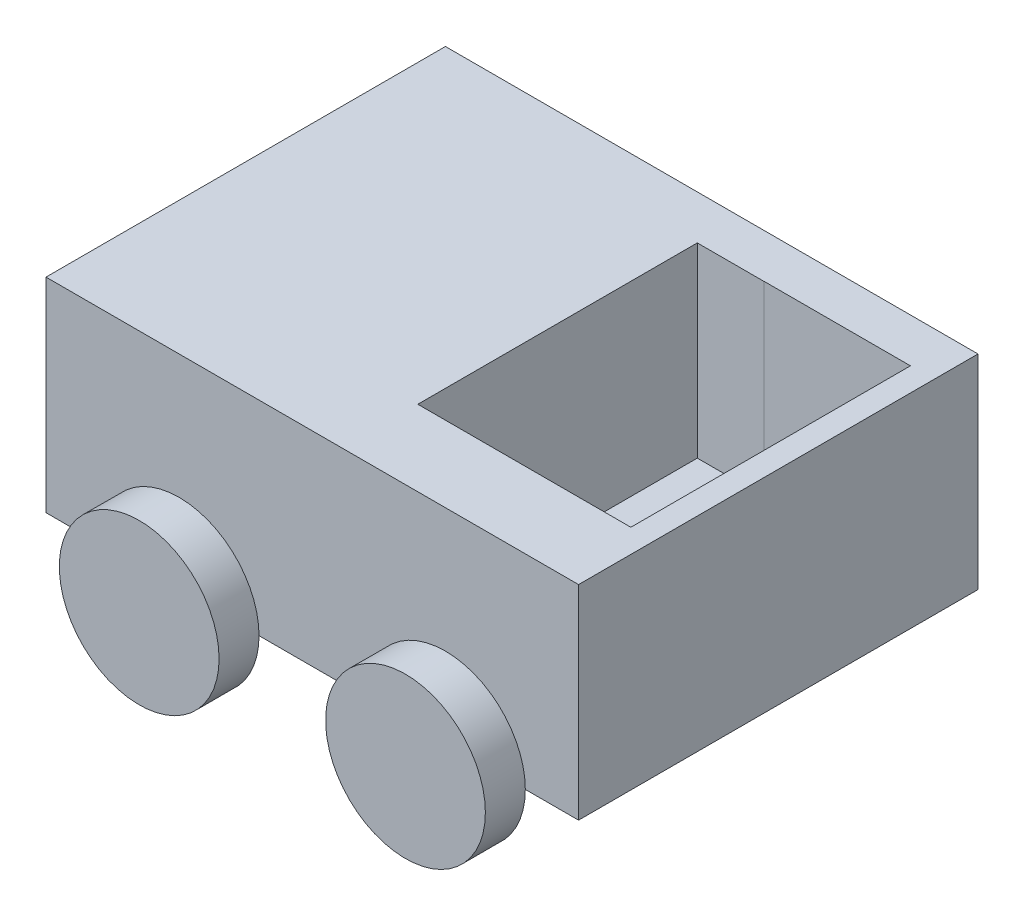
ISO-10303-21;
HEADER;
FILE_DESCRIPTION(('STEP AP214'),'2;1');
FILE_NAME('part.step','',(''),(''),'','','');
FILE_SCHEMA(('AUTOMOTIVE_DESIGN { 1 0 10303 214 1 1 1 1 }'));
ENDSEC;
DATA;
#1=APPLICATION_CONTEXT('core data for automotive mechanical design processes');
#2=APPLICATION_PROTOCOL_DEFINITION('international standard','automotive_design',2000,#1);
#3=PRODUCT_CONTEXT('',#1,'mechanical');
#4=PRODUCT('Part','Part','',(#3));
#5=PRODUCT_RELATED_PRODUCT_CATEGORY('part','',(#4));
#6=PRODUCT_DEFINITION_FORMATION('','',#4);
#7=PRODUCT_DEFINITION_CONTEXT('part definition',#1,'design');
#8=PRODUCT_DEFINITION('design','',#6,#7);
#9=PRODUCT_DEFINITION_SHAPE('','',#8);
#10=(LENGTH_UNIT() NAMED_UNIT(*) SI_UNIT(.MILLI.,.METRE.));
#11=(NAMED_UNIT(*) PLANE_ANGLE_UNIT() SI_UNIT($,.RADIAN.));
#12=(NAMED_UNIT(*) SI_UNIT($,.STERADIAN.) SOLID_ANGLE_UNIT());
#13=UNCERTAINTY_MEASURE_WITH_UNIT(LENGTH_MEASURE(1.E-05),#10,'distance_accuracy_value','');
#14=(GEOMETRIC_REPRESENTATION_CONTEXT(3) GLOBAL_UNCERTAINTY_ASSIGNED_CONTEXT((#13)) GLOBAL_UNIT_ASSIGNED_CONTEXT((#10,
#11,#12)) REPRESENTATION_CONTEXT('',''));
#15=CARTESIAN_POINT('',(0.,0.,0.));
#16=DIRECTION('',(0.,0.,1.));
#17=DIRECTION('',(1.,0.,0.));
#18=AXIS2_PLACEMENT_3D('',#15,#16,#17);
#19=CARTESIAN_POINT('',(0.,0.,15.));
#20=DIRECTION('',(1.,0.,0.));
#21=DIRECTION('',(0.,0.,-1.));
#22=AXIS2_PLACEMENT_3D('',#19,#20,#21);
#23=PLANE('',#22);
#24=DIRECTION('',(0.,-1.,0.));
#25=VECTOR('',#24,1.);
#26=CARTESIAN_POINT('',(0.,0.,0.));
#27=LINE('',#26,#25);
#28=CARTESIAN_POINT('',(0.,0.,0.));
#29=VERTEX_POINT('',#28);
#30=CARTESIAN_POINT('',(0.,-7.66303920543227,0.));
#31=VERTEX_POINT('',#30);
#32=EDGE_CURVE('E200',#29,#31,#27,.T.);
#33=ORIENTED_EDGE('',*,*,#32,.T.);
#34=DIRECTION('',(0.,0.,-1.));
#35=VECTOR('',#34,1.);
#36=CARTESIAN_POINT('',(0.,-7.66303920543227,15.));
#37=LINE('',#36,#35);
#38=CARTESIAN_POINT('',(0.,-7.66303920543227,15.));
#39=VERTEX_POINT('',#38);
#40=EDGE_CURVE('E11',#39,#31,#37,.T.);
#41=ORIENTED_EDGE('',*,*,#40,.F.);
#42=DIRECTION('',(0.,-1.,0.));
#43=VECTOR('',#42,1.);
#44=CARTESIAN_POINT('',(0.,0.,15.));
#45=LINE('',#44,#43);
#46=CARTESIAN_POINT('',(0.,0.,15.));
#47=VERTEX_POINT('',#46);
#48=EDGE_CURVE('E206',#47,#39,#45,.T.);
#49=ORIENTED_EDGE('',*,*,#48,.F.);
#50=DIRECTION('',(0.,0.,-1.));
#51=VECTOR('',#50,1.);
#52=CARTESIAN_POINT('',(0.,0.,15.));
#53=LINE('',#52,#51);
#54=EDGE_CURVE('E227',#47,#29,#53,.T.);
#55=ORIENTED_EDGE('',*,*,#54,.T.);
#56=EDGE_LOOP('',(#33,#41,#49,#55));
#57=FACE_BOUND('',#56,.T.);
#58=ADVANCED_FACE('F39',(#57),#23,.F.);
#59=CARTESIAN_POINT('',(0.,-7.66303920543227,15.));
#60=DIRECTION('',(0.,1.,0.));
#61=DIRECTION('',(0.,0.,1.));
#62=AXIS2_PLACEMENT_3D('',#59,#60,#61);
#63=PLANE('',#62);
#64=DIRECTION('',(1.,0.,0.));
#65=VECTOR('',#64,1.);
#66=CARTESIAN_POINT('',(0.,-7.66303920543227,0.));
#67=LINE('',#66,#65);
#68=CARTESIAN_POINT('',(2.,-7.66303920543227,0.));
#69=VERTEX_POINT('',#68);
#70=EDGE_CURVE('E232',#31,#69,#67,.T.);
#71=ORIENTED_EDGE('',*,*,#70,.T.);
#72=CARTESIAN_POINT('',(8.,-7.66303920543227,0.));
#73=VERTEX_POINT('',#72);
#74=EDGE_CURVE('E236',#69,#73,#67,.T.);
#75=ORIENTED_EDGE('',*,*,#74,.T.);
#76=CARTESIAN_POINT('',(12.,-7.66303920543227,0.));
#77=VERTEX_POINT('',#76);
#78=EDGE_CURVE('E61',#73,#77,#67,.T.);
#79=ORIENTED_EDGE('',*,*,#78,.T.);
#80=CARTESIAN_POINT('',(18.,-7.66303920543227,0.));
#81=VERTEX_POINT('',#80);
#82=EDGE_CURVE('E237',#77,#81,#67,.T.);
#83=ORIENTED_EDGE('',*,*,#82,.T.);
#84=CARTESIAN_POINT('',(20.,-7.66303920543227,0.));
#85=VERTEX_POINT('',#84);
#86=EDGE_CURVE('E231',#81,#85,#67,.T.);
#87=ORIENTED_EDGE('',*,*,#86,.T.);
#88=DIRECTION('',(0.,0.,-1.));
#89=VECTOR('',#88,1.);
#90=CARTESIAN_POINT('',(20.,-7.66303920543227,15.));
#91=LINE('',#90,#89);
#92=CARTESIAN_POINT('',(20.,-7.66303920543227,15.));
#93=VERTEX_POINT('',#92);
#94=EDGE_CURVE('E47',#93,#85,#91,.T.);
#95=ORIENTED_EDGE('',*,*,#94,.F.);
#96=DIRECTION('',(1.,0.,0.));
#97=VECTOR('',#96,1.);
#98=CARTESIAN_POINT('',(0.,-7.66303920543227,15.));
#99=LINE('',#98,#97);
#100=CARTESIAN_POINT('',(18.,-7.66303920543227,15.));
#101=VERTEX_POINT('',#100);
#102=EDGE_CURVE('E210',#101,#93,#99,.T.);
#103=ORIENTED_EDGE('',*,*,#102,.F.);
#104=CARTESIAN_POINT('',(12.,-7.66303920543227,15.));
#105=VERTEX_POINT('',#104);
#106=EDGE_CURVE('E219',#105,#101,#99,.T.);
#107=ORIENTED_EDGE('',*,*,#106,.F.);
#108=CARTESIAN_POINT('',(8.,-7.66303920543227,15.));
#109=VERTEX_POINT('',#108);
#110=EDGE_CURVE('E218',#109,#105,#99,.T.);
#111=ORIENTED_EDGE('',*,*,#110,.F.);
#112=CARTESIAN_POINT('',(2.,-7.66303920543227,15.));
#113=VERTEX_POINT('',#112);
#114=EDGE_CURVE('E217',#113,#109,#99,.T.);
#115=ORIENTED_EDGE('',*,*,#114,.F.);
#116=EDGE_CURVE('E212',#39,#113,#99,.T.);
#117=ORIENTED_EDGE('',*,*,#116,.F.);
#118=ORIENTED_EDGE('',*,*,#40,.T.);
#119=EDGE_LOOP('',(#71,#75,#79,#83,#87,#95,#103,#107,#111,#115,#117,#118));
#120=FACE_BOUND('',#119,.T.);
#121=ADVANCED_FACE('F283',(#120),#63,.F.);
#122=CARTESIAN_POINT('',(20.,0.,15.));
#123=DIRECTION('',(1.,0.,0.));
#124=DIRECTION('',(0.,0.,-1.));
#125=AXIS2_PLACEMENT_3D('',#122,#123,#124);
#126=PLANE('',#125);
#127=DIRECTION('',(0.,-1.,0.));
#128=VECTOR('',#127,1.);
#129=CARTESIAN_POINT('',(20.,0.,0.));
#130=LINE('',#129,#128);
#131=CARTESIAN_POINT('',(20.,0.,0.));
#132=VERTEX_POINT('',#131);
#133=EDGE_CURVE('E235',#132,#85,#130,.T.);
#134=ORIENTED_EDGE('',*,*,#133,.F.);
#135=DIRECTION('',(0.,0.,-1.));
#136=VECTOR('',#135,1.);
#137=CARTESIAN_POINT('',(20.,0.,15.));
#138=LINE('',#137,#136);
#139=CARTESIAN_POINT('',(20.,0.,15.));
#140=VERTEX_POINT('',#139);
#141=EDGE_CURVE('E246',#140,#132,#138,.T.);
#142=ORIENTED_EDGE('',*,*,#141,.F.);
#143=DIRECTION('',(0.,-1.,0.));
#144=VECTOR('',#143,1.);
#145=CARTESIAN_POINT('',(20.,0.,15.));
#146=LINE('',#145,#144);
#147=EDGE_CURVE('E216',#140,#93,#146,.T.);
#148=ORIENTED_EDGE('',*,*,#147,.T.);
#149=ORIENTED_EDGE('',*,*,#94,.T.);
#150=EDGE_LOOP('',(#134,#142,#148,#149));
#151=FACE_BOUND('',#150,.T.);
#152=ADVANCED_FACE('F253',(#151),#126,.T.);
#153=CARTESIAN_POINT('',(0.,0.,15.));
#154=DIRECTION('',(0.,1.,0.));
#155=DIRECTION('',(0.,0.,1.));
#156=AXIS2_PLACEMENT_3D('',#153,#154,#155);
#157=PLANE('',#156);
#158=DIRECTION('',(1.,0.,0.));
#159=VECTOR('',#158,1.);
#160=CARTESIAN_POINT('',(13.6173192572823,0.,12.154304489078));
#161=LINE('',#160,#159);
#162=CARTESIAN_POINT('',(11.1173192572823,0.,12.154304489078));
#163=VERTEX_POINT('',#162);
#164=CARTESIAN_POINT('',(19.1173192572823,0.,12.154304489078));
#165=VERTEX_POINT('',#164);
#166=EDGE_CURVE('E190',#163,#165,#161,.T.);
#167=ORIENTED_EDGE('',*,*,#166,.F.);
#168=DIRECTION('',(0.,0.,1.));
#169=VECTOR('',#168,1.);
#170=CARTESIAN_POINT('',(11.1173192572823,0.,12.154304489078));
#171=LINE('',#170,#169);
#172=CARTESIAN_POINT('',(11.1173192572823,0.,1.65842644604908));
#173=VERTEX_POINT('',#172);
#174=EDGE_CURVE('E152',#173,#163,#171,.T.);
#175=ORIENTED_EDGE('',*,*,#174,.F.);
#176=DIRECTION('',(-1.,0.,0.));
#177=VECTOR('',#176,1.);
#178=CARTESIAN_POINT('',(13.6173192572823,0.,1.65842644604908));
#179=LINE('',#178,#177);
#180=CARTESIAN_POINT('',(13.6173192572823,0.,1.65842644604908));
#181=VERTEX_POINT('',#180);
#182=EDGE_CURVE('E328',#181,#173,#179,.T.);
#183=ORIENTED_EDGE('',*,*,#182,.F.);
#184=DIRECTION('',(0.,0.,1.));
#185=VECTOR('',#184,1.);
#186=CARTESIAN_POINT('',(13.6173192572823,0.,1.65430448907804));
#187=LINE('',#186,#185);
#188=CARTESIAN_POINT('',(13.6173192572823,0.,1.65430448907804));
#189=VERTEX_POINT('',#188);
#190=EDGE_CURVE('E162',#189,#181,#187,.T.);
#191=ORIENTED_EDGE('',*,*,#190,.F.);
#192=DIRECTION('',(-1.,0.,0.));
#193=VECTOR('',#192,1.);
#194=CARTESIAN_POINT('',(19.1173192572823,0.,1.65430448907804));
#195=LINE('',#194,#193);
#196=CARTESIAN_POINT('',(19.1173192572823,0.,1.65430448907804));
#197=VERTEX_POINT('',#196);
#198=EDGE_CURVE('E184',#197,#189,#195,.T.);
#199=ORIENTED_EDGE('',*,*,#198,.F.);
#200=DIRECTION('',(0.,0.,1.));
#201=VECTOR('',#200,1.);
#202=CARTESIAN_POINT('',(19.1173192572823,0.,1.65430448907804));
#203=LINE('',#202,#201);
#204=EDGE_CURVE('E177',#197,#165,#203,.T.);
#205=ORIENTED_EDGE('',*,*,#204,.T.);
#206=EDGE_LOOP('',(#167,#175,#183,#191,#199,#205));
#207=FACE_BOUND('',#206,.T.);
#208=DIRECTION('',(1.,0.,0.));
#209=VECTOR('',#208,1.);
#210=CARTESIAN_POINT('',(0.,0.,0.));
#211=LINE('',#210,#209);
#212=EDGE_CURVE('E211',#29,#132,#211,.T.);
#213=ORIENTED_EDGE('',*,*,#212,.F.);
#214=ORIENTED_EDGE('',*,*,#54,.F.);
#215=DIRECTION('',(1.,0.,0.));
#216=VECTOR('',#215,1.);
#217=CARTESIAN_POINT('',(0.,0.,15.));
#218=LINE('',#217,#216);
#219=EDGE_CURVE('E223',#47,#140,#218,.T.);
#220=ORIENTED_EDGE('',*,*,#219,.T.);
#221=ORIENTED_EDGE('',*,*,#141,.T.);
#222=EDGE_LOOP('',(#213,#214,#220,#221));
#223=FACE_BOUND('',#222,.T.);
#224=ADVANCED_FACE('F262',(#207,#223),#157,.T.);
#225=CARTESIAN_POINT('',(0.,0.,15.));
#226=DIRECTION('',(0.,0.,1.));
#227=DIRECTION('',(1.,0.,0.));
#228=AXIS2_PLACEMENT_3D('',#225,#226,#227);
#229=PLANE('',#228);
#230=ORIENTED_EDGE('',*,*,#116,.T.);
#231=CARTESIAN_POINT('',(5.,-7.66303920543227,15.));
#232=DIRECTION('',(0.,0.,1.));
#233=DIRECTION('',(1.,0.,0.));
#234=AXIS2_PLACEMENT_3D('',#231,#232,#233);
#235=CIRCLE('',#234,3.);
#236=EDGE_CURVE('E281',#109,#113,#235,.T.);
#237=ORIENTED_EDGE('',*,*,#236,.F.);
#238=ORIENTED_EDGE('',*,*,#110,.T.);
#239=CARTESIAN_POINT('',(15.,-7.66303920543227,15.));
#240=DIRECTION('',(0.,0.,1.));
#241=DIRECTION('',(1.,0.,0.));
#242=AXIS2_PLACEMENT_3D('',#239,#240,#241);
#243=CIRCLE('',#242,3.);
#244=EDGE_CURVE('E268',#101,#105,#243,.T.);
#245=ORIENTED_EDGE('',*,*,#244,.F.);
#246=ORIENTED_EDGE('',*,*,#102,.T.);
#247=ORIENTED_EDGE('',*,*,#147,.F.);
#248=ORIENTED_EDGE('',*,*,#219,.F.);
#249=ORIENTED_EDGE('',*,*,#48,.T.);
#250=EDGE_LOOP('',(#230,#237,#238,#245,#246,#247,#248,#249));
#251=FACE_BOUND('',#250,.T.);
#252=ADVANCED_FACE('F266',(#251),#229,.T.);
#253=CARTESIAN_POINT('',(0.,0.,0.));
#254=DIRECTION('',(0.,0.,1.));
#255=DIRECTION('',(1.,0.,0.));
#256=AXIS2_PLACEMENT_3D('',#253,#254,#255);
#257=PLANE('',#256);
#258=CARTESIAN_POINT('',(5.,-7.66303920543227,0.));
#259=DIRECTION('',(0.,0.,-1.));
#260=DIRECTION('',(-1.,0.,0.));
#261=AXIS2_PLACEMENT_3D('',#258,#259,#260);
#262=CIRCLE('',#261,3.);
#263=EDGE_CURVE('E54',#69,#73,#262,.T.);
#264=ORIENTED_EDGE('',*,*,#263,.F.);
#265=ORIENTED_EDGE('',*,*,#70,.F.);
#266=ORIENTED_EDGE('',*,*,#32,.F.);
#267=ORIENTED_EDGE('',*,*,#212,.T.);
#268=ORIENTED_EDGE('',*,*,#133,.T.);
#269=ORIENTED_EDGE('',*,*,#86,.F.);
#270=CARTESIAN_POINT('',(15.,-7.66303920543227,0.));
#271=DIRECTION('',(0.,0.,-1.));
#272=DIRECTION('',(-1.,0.,0.));
#273=AXIS2_PLACEMENT_3D('',#270,#271,#272);
#274=CIRCLE('',#273,3.);
#275=EDGE_CURVE('E303',#77,#81,#274,.T.);
#276=ORIENTED_EDGE('',*,*,#275,.F.);
#277=ORIENTED_EDGE('',*,*,#78,.F.);
#278=EDGE_LOOP('',(#264,#265,#266,#267,#268,#269,#276,#277));
#279=FACE_BOUND('',#278,.T.);
#280=ADVANCED_FACE('F257',(#279),#257,.F.);
#281=CARTESIAN_POINT('',(19.1173192572823,-7.,1.65430448907804));
#282=DIRECTION('',(0.,0.,-1.));
#283=DIRECTION('',(-1.,0.,0.));
#284=AXIS2_PLACEMENT_3D('',#281,#282,#283);
#285=PLANE('',#284);
#286=ORIENTED_EDGE('',*,*,#198,.T.);
#287=DIRECTION('',(0.,1.,0.));
#288=VECTOR('',#287,1.);
#289=CARTESIAN_POINT('',(13.6173192572823,-7.,1.65430448907804));
#290=LINE('',#289,#288);
#291=CARTESIAN_POINT('',(13.6173192572823,-7.,1.65430448907804));
#292=VERTEX_POINT('',#291);
#293=EDGE_CURVE('E183',#292,#189,#290,.T.);
#294=ORIENTED_EDGE('',*,*,#293,.F.);
#295=DIRECTION('',(-1.,0.,0.));
#296=VECTOR('',#295,1.);
#297=CARTESIAN_POINT('',(19.1173192572823,-7.,1.65430448907804));
#298=LINE('',#297,#296);
#299=CARTESIAN_POINT('',(19.1173192572823,-7.,1.65430448907804));
#300=VERTEX_POINT('',#299);
#301=EDGE_CURVE('E168',#300,#292,#298,.T.);
#302=ORIENTED_EDGE('',*,*,#301,.F.);
#303=DIRECTION('',(0.,1.,0.));
#304=VECTOR('',#303,1.);
#305=CARTESIAN_POINT('',(19.1173192572823,-7.,1.65430448907804));
#306=LINE('',#305,#304);
#307=EDGE_CURVE('E197',#300,#197,#306,.T.);
#308=ORIENTED_EDGE('',*,*,#307,.T.);
#309=EDGE_LOOP('',(#286,#294,#302,#308));
#310=FACE_BOUND('',#309,.T.);
#311=ADVANCED_FACE('F344',(#310),#285,.F.);
#312=CARTESIAN_POINT('',(19.1173192572823,-7.,1.65430448907804));
#313=DIRECTION('',(-1.,0.,0.));
#314=DIRECTION('',(0.,0.,1.));
#315=AXIS2_PLACEMENT_3D('',#312,#313,#314);
#316=PLANE('',#315);
#317=ORIENTED_EDGE('',*,*,#204,.F.);
#318=ORIENTED_EDGE('',*,*,#307,.F.);
#319=DIRECTION('',(0.,0.,1.));
#320=VECTOR('',#319,1.);
#321=CARTESIAN_POINT('',(19.1173192572823,-7.,1.65430448907804));
#322=LINE('',#321,#320);
#323=CARTESIAN_POINT('',(19.1173192572823,-7.,12.154304489078));
#324=VERTEX_POINT('',#323);
#325=EDGE_CURVE('E175',#300,#324,#322,.T.);
#326=ORIENTED_EDGE('',*,*,#325,.T.);
#327=DIRECTION('',(0.,1.,0.));
#328=VECTOR('',#327,1.);
#329=CARTESIAN_POINT('',(19.1173192572823,-7.,12.154304489078));
#330=LINE('',#329,#328);
#331=EDGE_CURVE('E201',#324,#165,#330,.T.);
#332=ORIENTED_EDGE('',*,*,#331,.T.);
#333=EDGE_LOOP('',(#317,#318,#326,#332));
#334=FACE_BOUND('',#333,.T.);
#335=ADVANCED_FACE('F341',(#334),#316,.T.);
#336=CARTESIAN_POINT('',(13.6173192572823,-7.,12.154304489078));
#337=DIRECTION('',(0.,0.,1.));
#338=DIRECTION('',(1.,0.,0.));
#339=AXIS2_PLACEMENT_3D('',#336,#337,#338);
#340=PLANE('',#339);
#341=ORIENTED_EDGE('',*,*,#166,.T.);
#342=ORIENTED_EDGE('',*,*,#331,.F.);
#343=DIRECTION('',(1.,0.,0.));
#344=VECTOR('',#343,1.);
#345=CARTESIAN_POINT('',(13.6173192572823,-7.,12.154304489078));
#346=LINE('',#345,#344);
#347=CARTESIAN_POINT('',(11.1173192572823,-7.,12.154304489078));
#348=VERTEX_POINT('',#347);
#349=EDGE_CURVE('E170',#348,#324,#346,.T.);
#350=ORIENTED_EDGE('',*,*,#349,.F.);
#351=DIRECTION('',(0.,1.,0.));
#352=VECTOR('',#351,1.);
#353=CARTESIAN_POINT('',(11.1173192572823,-7.,12.154304489078));
#354=LINE('',#353,#352);
#355=EDGE_CURVE('E321',#348,#163,#354,.T.);
#356=ORIENTED_EDGE('',*,*,#355,.T.);
#357=EDGE_LOOP('',(#341,#342,#350,#356));
#358=FACE_BOUND('',#357,.T.);
#359=ADVANCED_FACE('F337',(#358),#340,.F.);
#360=CARTESIAN_POINT('',(13.6173192572823,-7.,1.65430448907804));
#361=DIRECTION('',(-1.,0.,0.));
#362=DIRECTION('',(0.,0.,1.));
#363=AXIS2_PLACEMENT_3D('',#360,#361,#362);
#364=PLANE('',#363);
#365=ORIENTED_EDGE('',*,*,#190,.T.);
#366=DIRECTION('',(0.,1.,0.));
#367=VECTOR('',#366,1.);
#368=CARTESIAN_POINT('',(13.6173192572823,-7.,1.65842644604908));
#369=LINE('',#368,#367);
#370=CARTESIAN_POINT('',(13.6173192572823,-7.,1.65842644604908));
#371=VERTEX_POINT('',#370);
#372=EDGE_CURVE('E143',#371,#181,#369,.T.);
#373=ORIENTED_EDGE('',*,*,#372,.F.);
#374=DIRECTION('',(0.,0.,1.));
#375=VECTOR('',#374,1.);
#376=CARTESIAN_POINT('',(13.6173192572823,-7.,1.65430448907804));
#377=LINE('',#376,#375);
#378=EDGE_CURVE('E159',#292,#371,#377,.T.);
#379=ORIENTED_EDGE('',*,*,#378,.F.);
#380=ORIENTED_EDGE('',*,*,#293,.T.);
#381=EDGE_LOOP('',(#365,#373,#379,#380));
#382=FACE_BOUND('',#381,.T.);
#383=ADVANCED_FACE('F157',(#382),#364,.F.);
#384=CARTESIAN_POINT('',(0.,-7.,0.));
#385=DIRECTION('',(0.,1.,0.));
#386=DIRECTION('',(0.,0.,1.));
#387=AXIS2_PLACEMENT_3D('',#384,#385,#386);
#388=PLANE('',#387);
#389=ORIENTED_EDGE('',*,*,#301,.T.);
#390=ORIENTED_EDGE('',*,*,#378,.T.);
#391=DIRECTION('',(-1.,0.,0.));
#392=VECTOR('',#391,1.);
#393=CARTESIAN_POINT('',(13.6173192572823,-7.,1.65842644604908));
#394=LINE('',#393,#392);
#395=CARTESIAN_POINT('',(11.1173192572823,-7.,1.65842644604908));
#396=VERTEX_POINT('',#395);
#397=EDGE_CURVE('E139',#371,#396,#394,.T.);
#398=ORIENTED_EDGE('',*,*,#397,.T.);
#399=DIRECTION('',(0.,0.,1.));
#400=VECTOR('',#399,1.);
#401=CARTESIAN_POINT('',(11.1173192572823,-7.,12.154304489078));
#402=LINE('',#401,#400);
#403=EDGE_CURVE('E151',#396,#348,#402,.T.);
#404=ORIENTED_EDGE('',*,*,#403,.T.);
#405=ORIENTED_EDGE('',*,*,#349,.T.);
#406=ORIENTED_EDGE('',*,*,#325,.F.);
#407=EDGE_LOOP('',(#389,#390,#398,#404,#405,#406));
#408=FACE_BOUND('',#407,.T.);
#409=ADVANCED_FACE('F165',(#408),#388,.T.);
#410=CARTESIAN_POINT('',(15.,-7.66303920543227,15.));
#411=DIRECTION('',(0.,0.,1.));
#412=DIRECTION('',(1.,0.,0.));
#413=AXIS2_PLACEMENT_3D('',#410,#411,#412);
#414=PLANE('',#413);
#415=EDGE_CURVE('E286',#105,#101,#243,.T.);
#416=ORIENTED_EDGE('',*,*,#415,.F.);
#417=ORIENTED_EDGE('',*,*,#106,.T.);
#418=EDGE_LOOP('',(#416,#417));
#419=FACE_BOUND('',#418,.T.);
#420=ADVANCED_FACE('F287',(#419),#414,.F.);
#421=CARTESIAN_POINT('',(15.,-7.66303920543227,16.5));
#422=DIRECTION('',(0.,0.,-1.));
#423=DIRECTION('',(-1.,0.,0.));
#424=AXIS2_PLACEMENT_3D('',#421,#422,#423);
#425=CYLINDRICAL_SURFACE('',#424,3.);
#426=CARTESIAN_POINT('',(15.,-7.66303920543227,16.5));
#427=DIRECTION('',(0.,0.,1.));
#428=DIRECTION('',(1.,0.,0.));
#429=AXIS2_PLACEMENT_3D('',#426,#427,#428);
#430=CIRCLE('',#429,3.);
#431=CARTESIAN_POINT('',(18.,-7.66303920543227,16.5));
#432=VERTEX_POINT('',#431);
#433=EDGE_CURVE('E187',#432,#432,#430,.T.);
#434=ORIENTED_EDGE('',*,*,#433,.F.);
#435=EDGE_LOOP('',(#434));
#436=FACE_BOUND('',#435,.T.);
#437=ORIENTED_EDGE('',*,*,#244,.T.);
#438=ORIENTED_EDGE('',*,*,#415,.T.);
#439=EDGE_LOOP('',(#437,#438));
#440=FACE_BOUND('',#439,.T.);
#441=ADVANCED_FACE('F291',(#436,#440),#425,.T.);
#442=CARTESIAN_POINT('',(15.,-7.66303920543227,16.5));
#443=DIRECTION('',(0.,0.,1.));
#444=DIRECTION('',(1.,0.,0.));
#445=AXIS2_PLACEMENT_3D('',#442,#443,#444);
#446=PLANE('',#445);
#447=ORIENTED_EDGE('',*,*,#433,.T.);
#448=EDGE_LOOP('',(#447));
#449=FACE_BOUND('',#448,.T.);
#450=ADVANCED_FACE('F377',(#449),#446,.T.);
#451=CARTESIAN_POINT('',(5.,-7.66303920543227,15.));
#452=DIRECTION('',(0.,0.,1.));
#453=DIRECTION('',(1.,0.,0.));
#454=AXIS2_PLACEMENT_3D('',#451,#452,#453);
#455=PLANE('',#454);
#456=EDGE_CURVE('E299',#113,#109,#235,.T.);
#457=ORIENTED_EDGE('',*,*,#456,.F.);
#458=ORIENTED_EDGE('',*,*,#114,.T.);
#459=EDGE_LOOP('',(#457,#458));
#460=FACE_BOUND('',#459,.T.);
#461=ADVANCED_FACE('F375',(#460),#455,.F.);
#462=CARTESIAN_POINT('',(5.,-7.66303920543227,16.5));
#463=DIRECTION('',(0.,0.,-1.));
#464=DIRECTION('',(-1.,0.,0.));
#465=AXIS2_PLACEMENT_3D('',#462,#463,#464);
#466=CYLINDRICAL_SURFACE('',#465,3.);
#467=CARTESIAN_POINT('',(5.,-7.66303920543227,16.5));
#468=DIRECTION('',(0.,0.,1.));
#469=DIRECTION('',(1.,0.,0.));
#470=AXIS2_PLACEMENT_3D('',#467,#468,#469);
#471=CIRCLE('',#470,3.);
#472=CARTESIAN_POINT('',(8.,-7.66303920543227,16.5));
#473=VERTEX_POINT('',#472);
#474=EDGE_CURVE('E290',#473,#473,#471,.T.);
#475=ORIENTED_EDGE('',*,*,#474,.F.);
#476=EDGE_LOOP('',(#475));
#477=FACE_BOUND('',#476,.T.);
#478=ORIENTED_EDGE('',*,*,#236,.T.);
#479=ORIENTED_EDGE('',*,*,#456,.T.);
#480=EDGE_LOOP('',(#478,#479));
#481=FACE_BOUND('',#480,.T.);
#482=ADVANCED_FACE('F374',(#477,#481),#466,.T.);
#483=CARTESIAN_POINT('',(5.,-7.66303920543227,16.5));
#484=DIRECTION('',(0.,0.,1.));
#485=DIRECTION('',(1.,0.,0.));
#486=AXIS2_PLACEMENT_3D('',#483,#484,#485);
#487=PLANE('',#486);
#488=ORIENTED_EDGE('',*,*,#474,.T.);
#489=EDGE_LOOP('',(#488));
#490=FACE_BOUND('',#489,.T.);
#491=ADVANCED_FACE('F383',(#490),#487,.T.);
#492=CARTESIAN_POINT('',(15.,-7.66303920543227,-1.5));
#493=DIRECTION('',(0.,0.,1.));
#494=DIRECTION('',(1.,0.,0.));
#495=AXIS2_PLACEMENT_3D('',#492,#493,#494);
#496=CYLINDRICAL_SURFACE('',#495,3.);
#497=CARTESIAN_POINT('',(15.,-7.66303920543227,-1.5));
#498=DIRECTION('',(0.,0.,-1.));
#499=DIRECTION('',(-1.,0.,0.));
#500=AXIS2_PLACEMENT_3D('',#497,#498,#499);
#501=CIRCLE('',#500,3.);
#502=CARTESIAN_POINT('',(12.,-7.66303920543227,-1.5));
#503=VERTEX_POINT('',#502);
#504=EDGE_CURVE('E307',#503,#503,#501,.T.);
#505=ORIENTED_EDGE('',*,*,#504,.F.);
#506=EDGE_LOOP('',(#505));
#507=FACE_BOUND('',#506,.T.);
#508=ORIENTED_EDGE('',*,*,#275,.T.);
#509=EDGE_CURVE('E308',#81,#77,#274,.T.);
#510=ORIENTED_EDGE('',*,*,#509,.T.);
#511=EDGE_LOOP('',(#508,#510));
#512=FACE_BOUND('',#511,.T.);
#513=ADVANCED_FACE('F469',(#507,#512),#496,.T.);
#514=CARTESIAN_POINT('',(15.,-7.66303920543227,-1.5));
#515=DIRECTION('',(0.,0.,-1.));
#516=DIRECTION('',(-1.,0.,0.));
#517=AXIS2_PLACEMENT_3D('',#514,#515,#516);
#518=PLANE('',#517);
#519=ORIENTED_EDGE('',*,*,#504,.T.);
#520=EDGE_LOOP('',(#519));
#521=FACE_BOUND('',#520,.T.);
#522=ADVANCED_FACE('F527',(#521),#518,.T.);
#523=CARTESIAN_POINT('',(15.,-7.66303920543227,0.));
#524=DIRECTION('',(0.,0.,-1.));
#525=DIRECTION('',(-1.,0.,0.));
#526=AXIS2_PLACEMENT_3D('',#523,#524,#525);
#527=PLANE('',#526);
#528=ORIENTED_EDGE('',*,*,#82,.F.);
#529=ORIENTED_EDGE('',*,*,#509,.F.);
#530=EDGE_LOOP('',(#528,#529));
#531=FACE_BOUND('',#530,.T.);
#532=ADVANCED_FACE('F518',(#531),#527,.F.);
#533=CARTESIAN_POINT('',(5.,-7.66303920543227,0.));
#534=DIRECTION('',(0.,0.,-1.));
#535=DIRECTION('',(-1.,0.,0.));
#536=AXIS2_PLACEMENT_3D('',#533,#534,#535);
#537=PLANE('',#536);
#538=EDGE_CURVE('E315',#73,#69,#262,.T.);
#539=ORIENTED_EDGE('',*,*,#538,.F.);
#540=ORIENTED_EDGE('',*,*,#74,.F.);
#541=EDGE_LOOP('',(#539,#540));
#542=FACE_BOUND('',#541,.T.);
#543=ADVANCED_FACE('F365',(#542),#537,.F.);
#544=CARTESIAN_POINT('',(5.,-7.66303920543227,-1.5));
#545=DIRECTION('',(0.,0.,1.));
#546=DIRECTION('',(1.,0.,0.));
#547=AXIS2_PLACEMENT_3D('',#544,#545,#546);
#548=CYLINDRICAL_SURFACE('',#547,3.);
#549=CARTESIAN_POINT('',(5.,-7.66303920543227,-1.5));
#550=DIRECTION('',(0.,0.,-1.));
#551=DIRECTION('',(-1.,0.,0.));
#552=AXIS2_PLACEMENT_3D('',#549,#550,#551);
#553=CIRCLE('',#552,3.);
#554=CARTESIAN_POINT('',(2.,-7.66303920543227,-1.5));
#555=VERTEX_POINT('',#554);
#556=EDGE_CURVE('E314',#555,#555,#553,.T.);
#557=ORIENTED_EDGE('',*,*,#556,.F.);
#558=EDGE_LOOP('',(#557));
#559=FACE_BOUND('',#558,.T.);
#560=ORIENTED_EDGE('',*,*,#263,.T.);
#561=ORIENTED_EDGE('',*,*,#538,.T.);
#562=EDGE_LOOP('',(#560,#561));
#563=FACE_BOUND('',#562,.T.);
#564=ADVANCED_FACE('F368',(#559,#563),#548,.T.);
#565=CARTESIAN_POINT('',(5.,-7.66303920543227,-1.5));
#566=DIRECTION('',(0.,0.,-1.));
#567=DIRECTION('',(-1.,0.,0.));
#568=AXIS2_PLACEMENT_3D('',#565,#566,#567);
#569=PLANE('',#568);
#570=ORIENTED_EDGE('',*,*,#556,.T.);
#571=EDGE_LOOP('',(#570));
#572=FACE_BOUND('',#571,.T.);
#573=ADVANCED_FACE('F494',(#572),#569,.T.);
#574=CARTESIAN_POINT('',(11.1173192572823,-7.,12.154304489078));
#575=DIRECTION('',(-1.,0.,0.));
#576=DIRECTION('',(0.,0.,1.));
#577=AXIS2_PLACEMENT_3D('',#574,#575,#576);
#578=PLANE('',#577);
#579=ORIENTED_EDGE('',*,*,#174,.T.);
#580=ORIENTED_EDGE('',*,*,#355,.F.);
#581=ORIENTED_EDGE('',*,*,#403,.F.);
#582=DIRECTION('',(0.,1.,0.));
#583=VECTOR('',#582,1.);
#584=CARTESIAN_POINT('',(11.1173192572823,-7.,1.65842644604908));
#585=LINE('',#584,#583);
#586=EDGE_CURVE('E145',#396,#173,#585,.T.);
#587=ORIENTED_EDGE('',*,*,#586,.T.);
#588=EDGE_LOOP('',(#579,#580,#581,#587));
#589=FACE_BOUND('',#588,.T.);
#590=ADVANCED_FACE('F334',(#589),#578,.F.);
#591=CARTESIAN_POINT('',(13.6173192572823,-7.,1.65842644604908));
#592=DIRECTION('',(0.,0.,-1.));
#593=DIRECTION('',(-1.,0.,0.));
#594=AXIS2_PLACEMENT_3D('',#591,#592,#593);
#595=PLANE('',#594);
#596=ORIENTED_EDGE('',*,*,#182,.T.);
#597=ORIENTED_EDGE('',*,*,#586,.F.);
#598=ORIENTED_EDGE('',*,*,#397,.F.);
#599=ORIENTED_EDGE('',*,*,#372,.T.);
#600=EDGE_LOOP('',(#596,#597,#598,#599));
#601=FACE_BOUND('',#600,.T.);
#602=ADVANCED_FACE('F142',(#601),#595,.F.);
#603=CLOSED_SHELL('',(#58,#121,#152,#224,#252,#280,#311,#335,#359,#383,#409,#420,#441,#450,#461,
#482,#491,#513,#522,#532,#543,#564,#573,#590,#602));
#604=MANIFOLD_SOLID_BREP('B2',#603);
#605=ADVANCED_BREP_SHAPE_REPRESENTATION('',(#18,#604),#14);
#606=SHAPE_DEFINITION_REPRESENTATION(#9,#605);
ENDSEC;
END-ISO-10303-21;
